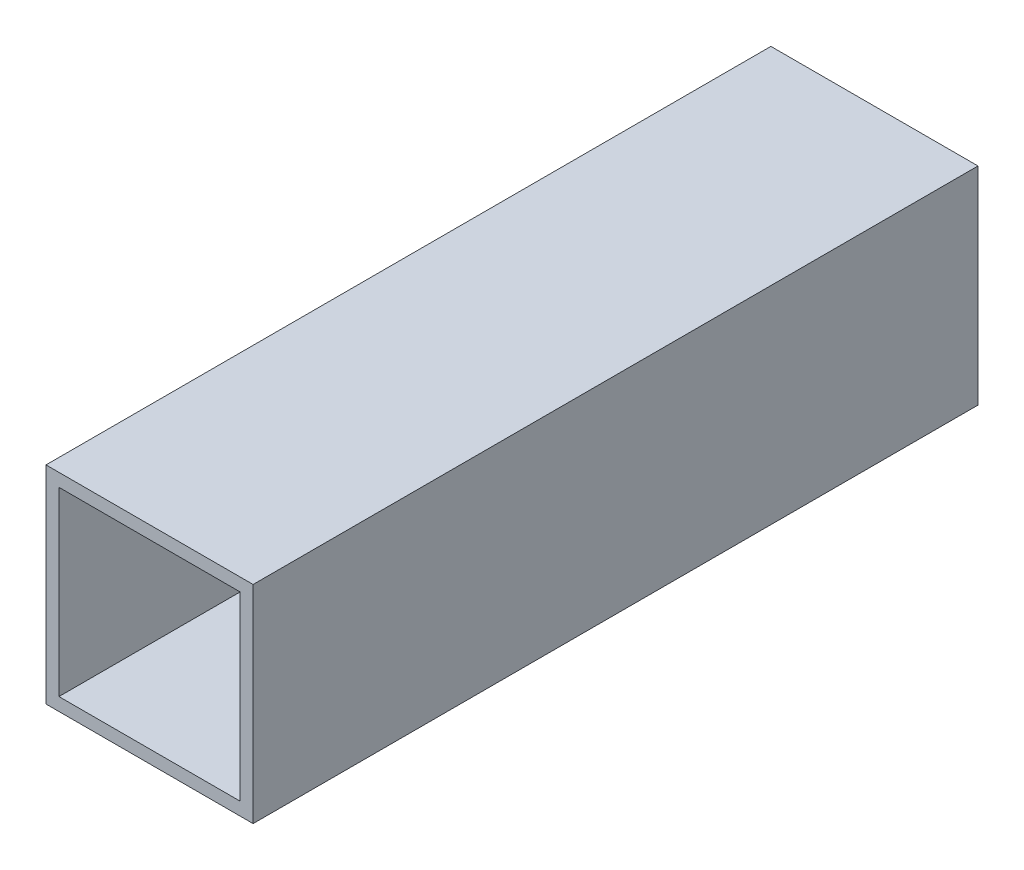
ISO-10303-21;
HEADER;
FILE_DESCRIPTION(('STEP AP214'),'2;1');
FILE_NAME('part.step','',(''),(''),'','','');
FILE_SCHEMA(('AUTOMOTIVE_DESIGN { 1 0 10303 214 1 1 1 1 }'));
ENDSEC;
DATA;
#1=APPLICATION_CONTEXT('core data for automotive mechanical design processes');
#2=APPLICATION_PROTOCOL_DEFINITION('international standard','automotive_design',2000,#1);
#3=PRODUCT_CONTEXT('',#1,'mechanical');
#4=PRODUCT('Part','Part','',(#3));
#5=PRODUCT_RELATED_PRODUCT_CATEGORY('part','',(#4));
#6=PRODUCT_DEFINITION_FORMATION('','',#4);
#7=PRODUCT_DEFINITION_CONTEXT('part definition',#1,'design');
#8=PRODUCT_DEFINITION('design','',#6,#7);
#9=PRODUCT_DEFINITION_SHAPE('','',#8);
#10=(LENGTH_UNIT() NAMED_UNIT(*) SI_UNIT(.MILLI.,.METRE.));
#11=(NAMED_UNIT(*) PLANE_ANGLE_UNIT() SI_UNIT($,.RADIAN.));
#12=(NAMED_UNIT(*) SI_UNIT($,.STERADIAN.) SOLID_ANGLE_UNIT());
#13=UNCERTAINTY_MEASURE_WITH_UNIT(LENGTH_MEASURE(1.E-05),#10,'distance_accuracy_value','');
#14=(GEOMETRIC_REPRESENTATION_CONTEXT(3) GLOBAL_UNCERTAINTY_ASSIGNED_CONTEXT((#13)) GLOBAL_UNIT_ASSIGNED_CONTEXT((#10,
#11,#12)) REPRESENTATION_CONTEXT('',''));
#15=CARTESIAN_POINT('',(0.,0.,0.));
#16=DIRECTION('',(0.,0.,1.));
#17=DIRECTION('',(1.,0.,0.));
#18=AXIS2_PLACEMENT_3D('',#15,#16,#17);
#19=CARTESIAN_POINT('',(0.,0.,-177.8));
#20=DIRECTION('',(0.,0.,1.));
#21=DIRECTION('',(-1.,0.,0.));
#22=AXIS2_PLACEMENT_3D('',#19,#20,#21);
#23=PLANE('',#22);
#24=DIRECTION('',(0.,-1.,0.));
#25=VECTOR('',#24,1.);
#26=CARTESIAN_POINT('',(0.,0.,-177.8));
#27=LINE('',#26,#25);
#28=CARTESIAN_POINT('',(0.,50.8,-177.8));
#29=VERTEX_POINT('',#28);
#30=CARTESIAN_POINT('',(0.,0.,-177.8));
#31=VERTEX_POINT('',#30);
#32=EDGE_CURVE('E136',#29,#31,#27,.T.);
#33=ORIENTED_EDGE('',*,*,#32,.F.);
#34=DIRECTION('',(-1.,0.,0.));
#35=VECTOR('',#34,1.);
#36=CARTESIAN_POINT('',(0.,50.8,-177.8));
#37=LINE('',#36,#35);
#38=CARTESIAN_POINT('',(50.8,50.8,-177.8));
#39=VERTEX_POINT('',#38);
#40=EDGE_CURVE('E146',#39,#29,#37,.T.);
#41=ORIENTED_EDGE('',*,*,#40,.F.);
#42=DIRECTION('',(0.,1.,0.));
#43=VECTOR('',#42,1.);
#44=CARTESIAN_POINT('',(50.8,0.,-177.8));
#45=LINE('',#44,#43);
#46=CARTESIAN_POINT('',(50.8,0.,-177.8));
#47=VERTEX_POINT('',#46);
#48=EDGE_CURVE('E143',#47,#39,#45,.T.);
#49=ORIENTED_EDGE('',*,*,#48,.F.);
#50=DIRECTION('',(1.,0.,0.));
#51=VECTOR('',#50,1.);
#52=CARTESIAN_POINT('',(0.,0.,-177.8));
#53=LINE('',#52,#51);
#54=EDGE_CURVE('E139',#31,#47,#53,.T.);
#55=ORIENTED_EDGE('',*,*,#54,.F.);
#56=EDGE_LOOP('',(#33,#41,#49,#55));
#57=FACE_BOUND('',#56,.T.);
#58=DIRECTION('',(1.,0.,0.));
#59=VECTOR('',#58,1.);
#60=CARTESIAN_POINT('',(3.175,3.175,-177.8));
#61=LINE('',#60,#59);
#62=CARTESIAN_POINT('',(3.175,3.175,-177.8));
#63=VERTEX_POINT('',#62);
#64=CARTESIAN_POINT('',(47.625,3.175,-177.8));
#65=VERTEX_POINT('',#64);
#66=EDGE_CURVE('E104',#63,#65,#61,.T.);
#67=ORIENTED_EDGE('',*,*,#66,.T.);
#68=DIRECTION('',(0.,1.,0.));
#69=VECTOR('',#68,1.);
#70=CARTESIAN_POINT('',(47.625,3.175,-177.8));
#71=LINE('',#70,#69);
#72=CARTESIAN_POINT('',(47.625,47.625,-177.8));
#73=VERTEX_POINT('',#72);
#74=EDGE_CURVE('E113',#65,#73,#71,.T.);
#75=ORIENTED_EDGE('',*,*,#74,.T.);
#76=DIRECTION('',(-1.,0.,0.));
#77=VECTOR('',#76,1.);
#78=CARTESIAN_POINT('',(3.175,47.625,-177.8));
#79=LINE('',#78,#77);
#80=CARTESIAN_POINT('',(3.175,47.625,-177.8));
#81=VERTEX_POINT('',#80);
#82=EDGE_CURVE('E117',#73,#81,#79,.T.);
#83=ORIENTED_EDGE('',*,*,#82,.T.);
#84=DIRECTION('',(0.,-1.,0.));
#85=VECTOR('',#84,1.);
#86=CARTESIAN_POINT('',(3.175,3.175,-177.8));
#87=LINE('',#86,#85);
#88=EDGE_CURVE('E120',#81,#63,#87,.T.);
#89=ORIENTED_EDGE('',*,*,#88,.T.);
#90=EDGE_LOOP('',(#67,#75,#83,#89));
#91=FACE_BOUND('',#90,.T.);
#92=ADVANCED_FACE('F37',(#57,#91),#23,.F.);
#93=CARTESIAN_POINT('',(0.,0.,0.));
#94=DIRECTION('',(0.,0.,1.));
#95=DIRECTION('',(-1.,0.,0.));
#96=AXIS2_PLACEMENT_3D('',#93,#94,#95);
#97=PLANE('',#96);
#98=DIRECTION('',(0.,-1.,0.));
#99=VECTOR('',#98,1.);
#100=CARTESIAN_POINT('',(0.,0.,0.));
#101=LINE('',#100,#99);
#102=CARTESIAN_POINT('',(0.,50.8,0.));
#103=VERTEX_POINT('',#102);
#104=CARTESIAN_POINT('',(0.,0.,0.));
#105=VERTEX_POINT('',#104);
#106=EDGE_CURVE('E109',#103,#105,#101,.T.);
#107=ORIENTED_EDGE('',*,*,#106,.T.);
#108=DIRECTION('',(1.,0.,0.));
#109=VECTOR('',#108,1.);
#110=CARTESIAN_POINT('',(0.,0.,0.));
#111=LINE('',#110,#109);
#112=CARTESIAN_POINT('',(50.8,0.,0.));
#113=VERTEX_POINT('',#112);
#114=EDGE_CURVE('E152',#105,#113,#111,.T.);
#115=ORIENTED_EDGE('',*,*,#114,.T.);
#116=DIRECTION('',(0.,1.,0.));
#117=VECTOR('',#116,1.);
#118=CARTESIAN_POINT('',(50.8,0.,0.));
#119=LINE('',#118,#117);
#120=CARTESIAN_POINT('',(50.8,50.8,0.));
#121=VERTEX_POINT('',#120);
#122=EDGE_CURVE('E155',#113,#121,#119,.T.);
#123=ORIENTED_EDGE('',*,*,#122,.T.);
#124=DIRECTION('',(-1.,0.,0.));
#125=VECTOR('',#124,1.);
#126=CARTESIAN_POINT('',(0.,50.8,0.));
#127=LINE('',#126,#125);
#128=EDGE_CURVE('E140',#121,#103,#127,.T.);
#129=ORIENTED_EDGE('',*,*,#128,.T.);
#130=EDGE_LOOP('',(#107,#115,#123,#129));
#131=FACE_BOUND('',#130,.T.);
#132=DIRECTION('',(0.,-1.,0.));
#133=VECTOR('',#132,1.);
#134=CARTESIAN_POINT('',(3.175,3.175,0.));
#135=LINE('',#134,#133);
#136=CARTESIAN_POINT('',(3.175,47.625,0.));
#137=VERTEX_POINT('',#136);
#138=CARTESIAN_POINT('',(3.175,3.175,0.));
#139=VERTEX_POINT('',#138);
#140=EDGE_CURVE('E121',#137,#139,#135,.T.);
#141=ORIENTED_EDGE('',*,*,#140,.F.);
#142=DIRECTION('',(-1.,0.,0.));
#143=VECTOR('',#142,1.);
#144=CARTESIAN_POINT('',(3.175,47.625,0.));
#145=LINE('',#144,#143);
#146=CARTESIAN_POINT('',(47.625,47.625,0.));
#147=VERTEX_POINT('',#146);
#148=EDGE_CURVE('E124',#147,#137,#145,.T.);
#149=ORIENTED_EDGE('',*,*,#148,.F.);
#150=DIRECTION('',(0.,1.,0.));
#151=VECTOR('',#150,1.);
#152=CARTESIAN_POINT('',(47.625,3.175,0.));
#153=LINE('',#152,#151);
#154=CARTESIAN_POINT('',(47.625,3.175,0.));
#155=VERTEX_POINT('',#154);
#156=EDGE_CURVE('E130',#155,#147,#153,.T.);
#157=ORIENTED_EDGE('',*,*,#156,.F.);
#158=DIRECTION('',(1.,0.,0.));
#159=VECTOR('',#158,1.);
#160=CARTESIAN_POINT('',(3.175,3.175,0.));
#161=LINE('',#160,#159);
#162=EDGE_CURVE('E105',#139,#155,#161,.T.);
#163=ORIENTED_EDGE('',*,*,#162,.F.);
#164=EDGE_LOOP('',(#141,#149,#157,#163));
#165=FACE_BOUND('',#164,.T.);
#166=ADVANCED_FACE('F172',(#131,#165),#97,.T.);
#167=CARTESIAN_POINT('',(0.,0.,-177.8));
#168=DIRECTION('',(1.,0.,0.));
#169=DIRECTION('',(0.,1.,0.));
#170=AXIS2_PLACEMENT_3D('',#167,#168,#169);
#171=PLANE('',#170);
#172=ORIENTED_EDGE('',*,*,#106,.F.);
#173=DIRECTION('',(0.,0.,1.));
#174=VECTOR('',#173,1.);
#175=CARTESIAN_POINT('',(0.,50.8,-177.8));
#176=LINE('',#175,#174);
#177=EDGE_CURVE('E149',#29,#103,#176,.T.);
#178=ORIENTED_EDGE('',*,*,#177,.F.);
#179=ORIENTED_EDGE('',*,*,#32,.T.);
#180=DIRECTION('',(0.,0.,1.));
#181=VECTOR('',#180,1.);
#182=CARTESIAN_POINT('',(0.,0.,-177.8));
#183=LINE('',#182,#181);
#184=EDGE_CURVE('E11',#31,#105,#183,.T.);
#185=ORIENTED_EDGE('',*,*,#184,.T.);
#186=EDGE_LOOP('',(#172,#178,#179,#185));
#187=FACE_BOUND('',#186,.T.);
#188=ADVANCED_FACE('F39',(#187),#171,.F.);
#189=CARTESIAN_POINT('',(0.,0.,-177.8));
#190=DIRECTION('',(0.,1.,0.));
#191=DIRECTION('',(0.,0.,-1.));
#192=AXIS2_PLACEMENT_3D('',#189,#190,#191);
#193=PLANE('',#192);
#194=ORIENTED_EDGE('',*,*,#114,.F.);
#195=ORIENTED_EDGE('',*,*,#184,.F.);
#196=ORIENTED_EDGE('',*,*,#54,.T.);
#197=DIRECTION('',(0.,0.,1.));
#198=VECTOR('',#197,1.);
#199=CARTESIAN_POINT('',(50.8,0.,-177.8));
#200=LINE('',#199,#198);
#201=EDGE_CURVE('E45',#47,#113,#200,.T.);
#202=ORIENTED_EDGE('',*,*,#201,.T.);
#203=EDGE_LOOP('',(#194,#195,#196,#202));
#204=FACE_BOUND('',#203,.T.);
#205=ADVANCED_FACE('F165',(#204),#193,.F.);
#206=CARTESIAN_POINT('',(50.8,0.,-177.8));
#207=DIRECTION('',(-1.,0.,0.));
#208=DIRECTION('',(0.,-1.,0.));
#209=AXIS2_PLACEMENT_3D('',#206,#207,#208);
#210=PLANE('',#209);
#211=ORIENTED_EDGE('',*,*,#122,.F.);
#212=ORIENTED_EDGE('',*,*,#201,.F.);
#213=ORIENTED_EDGE('',*,*,#48,.T.);
#214=DIRECTION('',(0.,0.,1.));
#215=VECTOR('',#214,1.);
#216=CARTESIAN_POINT('',(50.8,50.8,-177.8));
#217=LINE('',#216,#215);
#218=EDGE_CURVE('E161',#39,#121,#217,.T.);
#219=ORIENTED_EDGE('',*,*,#218,.T.);
#220=EDGE_LOOP('',(#211,#212,#213,#219));
#221=FACE_BOUND('',#220,.T.);
#222=ADVANCED_FACE('F169',(#221),#210,.F.);
#223=CARTESIAN_POINT('',(0.,50.8,-177.8));
#224=DIRECTION('',(0.,-1.,0.));
#225=DIRECTION('',(0.,0.,1.));
#226=AXIS2_PLACEMENT_3D('',#223,#224,#225);
#227=PLANE('',#226);
#228=ORIENTED_EDGE('',*,*,#128,.F.);
#229=ORIENTED_EDGE('',*,*,#218,.F.);
#230=ORIENTED_EDGE('',*,*,#40,.T.);
#231=ORIENTED_EDGE('',*,*,#177,.T.);
#232=EDGE_LOOP('',(#228,#229,#230,#231));
#233=FACE_BOUND('',#232,.T.);
#234=ADVANCED_FACE('F180',(#233),#227,.F.);
#235=CARTESIAN_POINT('',(3.175,3.175,-177.8));
#236=DIRECTION('',(0.,1.,0.));
#237=DIRECTION('',(0.,0.,-1.));
#238=AXIS2_PLACEMENT_3D('',#235,#236,#237);
#239=PLANE('',#238);
#240=ORIENTED_EDGE('',*,*,#162,.T.);
#241=DIRECTION('',(0.,0.,1.));
#242=VECTOR('',#241,1.);
#243=CARTESIAN_POINT('',(47.625,3.175,-177.8));
#244=LINE('',#243,#242);
#245=EDGE_CURVE('E100',#65,#155,#244,.T.);
#246=ORIENTED_EDGE('',*,*,#245,.F.);
#247=ORIENTED_EDGE('',*,*,#66,.F.);
#248=DIRECTION('',(0.,0.,1.));
#249=VECTOR('',#248,1.);
#250=CARTESIAN_POINT('',(3.175,3.175,-177.8));
#251=LINE('',#250,#249);
#252=EDGE_CURVE('E60',#63,#139,#251,.T.);
#253=ORIENTED_EDGE('',*,*,#252,.T.);
#254=EDGE_LOOP('',(#240,#246,#247,#253));
#255=FACE_BOUND('',#254,.T.);
#256=ADVANCED_FACE('F102',(#255),#239,.T.);
#257=CARTESIAN_POINT('',(47.625,3.175,-177.8));
#258=DIRECTION('',(-1.,0.,0.));
#259=DIRECTION('',(0.,0.,-1.));
#260=AXIS2_PLACEMENT_3D('',#257,#258,#259);
#261=PLANE('',#260);
#262=ORIENTED_EDGE('',*,*,#156,.T.);
#263=DIRECTION('',(0.,0.,1.));
#264=VECTOR('',#263,1.);
#265=CARTESIAN_POINT('',(47.625,47.625,-177.8));
#266=LINE('',#265,#264);
#267=EDGE_CURVE('E110',#73,#147,#266,.T.);
#268=ORIENTED_EDGE('',*,*,#267,.F.);
#269=ORIENTED_EDGE('',*,*,#74,.F.);
#270=ORIENTED_EDGE('',*,*,#245,.T.);
#271=EDGE_LOOP('',(#262,#268,#269,#270));
#272=FACE_BOUND('',#271,.T.);
#273=ADVANCED_FACE('F114',(#272),#261,.T.);
#274=CARTESIAN_POINT('',(3.175,47.625,-177.8));
#275=DIRECTION('',(0.,-1.,0.));
#276=DIRECTION('',(0.,0.,1.));
#277=AXIS2_PLACEMENT_3D('',#274,#275,#276);
#278=PLANE('',#277);
#279=ORIENTED_EDGE('',*,*,#148,.T.);
#280=DIRECTION('',(0.,0.,1.));
#281=VECTOR('',#280,1.);
#282=CARTESIAN_POINT('',(3.175,47.625,-177.8));
#283=LINE('',#282,#281);
#284=EDGE_CURVE('E52',#81,#137,#283,.T.);
#285=ORIENTED_EDGE('',*,*,#284,.F.);
#286=ORIENTED_EDGE('',*,*,#82,.F.);
#287=ORIENTED_EDGE('',*,*,#267,.T.);
#288=EDGE_LOOP('',(#279,#285,#286,#287));
#289=FACE_BOUND('',#288,.T.);
#290=ADVANCED_FACE('F198',(#289),#278,.T.);
#291=CARTESIAN_POINT('',(3.175,3.175,-177.8));
#292=DIRECTION('',(1.,0.,0.));
#293=DIRECTION('',(0.,0.,1.));
#294=AXIS2_PLACEMENT_3D('',#291,#292,#293);
#295=PLANE('',#294);
#296=ORIENTED_EDGE('',*,*,#140,.T.);
#297=ORIENTED_EDGE('',*,*,#252,.F.);
#298=ORIENTED_EDGE('',*,*,#88,.F.);
#299=ORIENTED_EDGE('',*,*,#284,.T.);
#300=EDGE_LOOP('',(#296,#297,#298,#299));
#301=FACE_BOUND('',#300,.T.);
#302=ADVANCED_FACE('F201',(#301),#295,.T.);
#303=CLOSED_SHELL('',(#92,#166,#188,#205,#222,#234,#256,#273,#290,#302));
#304=MANIFOLD_SOLID_BREP('B2',#303);
#305=ADVANCED_BREP_SHAPE_REPRESENTATION('',(#18,#304),#14);
#306=SHAPE_DEFINITION_REPRESENTATION(#9,#305);
ENDSEC;
END-ISO-10303-21;
